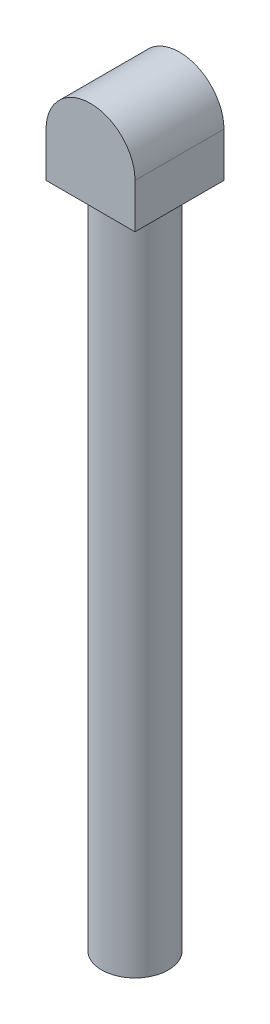
ISO-10303-21;
HEADER;
FILE_DESCRIPTION(('STEP AP214'),'2;1');
FILE_NAME('part.step','',(''),(''),'','','');
FILE_SCHEMA(('AUTOMOTIVE_DESIGN { 1 0 10303 214 1 1 1 1 }'));
ENDSEC;
DATA;
#1=APPLICATION_CONTEXT('core data for automotive mechanical design processes');
#2=APPLICATION_PROTOCOL_DEFINITION('international standard','automotive_design',2000,#1);
#3=PRODUCT_CONTEXT('',#1,'mechanical');
#4=PRODUCT('Part','Part','',(#3));
#5=PRODUCT_RELATED_PRODUCT_CATEGORY('part','',(#4));
#6=PRODUCT_DEFINITION_FORMATION('','',#4);
#7=PRODUCT_DEFINITION_CONTEXT('part definition',#1,'design');
#8=PRODUCT_DEFINITION('design','',#6,#7);
#9=PRODUCT_DEFINITION_SHAPE('','',#8);
#10=(LENGTH_UNIT() NAMED_UNIT(*) SI_UNIT(.MILLI.,.METRE.));
#11=(NAMED_UNIT(*) PLANE_ANGLE_UNIT() SI_UNIT($,.RADIAN.));
#12=(NAMED_UNIT(*) SI_UNIT($,.STERADIAN.) SOLID_ANGLE_UNIT());
#13=UNCERTAINTY_MEASURE_WITH_UNIT(LENGTH_MEASURE(1.E-05),#10,'distance_accuracy_value','');
#14=(GEOMETRIC_REPRESENTATION_CONTEXT(3) GLOBAL_UNCERTAINTY_ASSIGNED_CONTEXT((#13)) GLOBAL_UNIT_ASSIGNED_CONTEXT((#10,
#11,#12)) REPRESENTATION_CONTEXT('',''));
#15=CARTESIAN_POINT('',(0.,0.,0.));
#16=DIRECTION('',(0.,0.,1.));
#17=DIRECTION('',(1.,0.,0.));
#18=AXIS2_PLACEMENT_3D('',#15,#16,#17);
#19=CARTESIAN_POINT('',(4.,8.,-4.));
#20=DIRECTION('',(-1.,0.,0.));
#21=DIRECTION('',(0.,0.,1.));
#22=AXIS2_PLACEMENT_3D('',#19,#20,#21);
#23=PLANE('',#22);
#24=DIRECTION('',(0.,0.,1.));
#25=VECTOR('',#24,1.);
#26=CARTESIAN_POINT('',(4.,4.,-4.));
#27=LINE('',#26,#25);
#28=CARTESIAN_POINT('',(4.,4.,-4.));
#29=VERTEX_POINT('',#28);
#30=CARTESIAN_POINT('',(4.,4.,4.));
#31=VERTEX_POINT('',#30);
#32=EDGE_CURVE('E54',#29,#31,#27,.T.);
#33=ORIENTED_EDGE('',*,*,#32,.T.);
#34=DIRECTION('',(0.,-1.,0.));
#35=VECTOR('',#34,1.);
#36=CARTESIAN_POINT('',(4.,8.,4.));
#37=LINE('',#36,#35);
#38=CARTESIAN_POINT('',(4.,0.,4.));
#39=VERTEX_POINT('',#38);
#40=EDGE_CURVE('E96',#31,#39,#37,.T.);
#41=ORIENTED_EDGE('',*,*,#40,.T.);
#42=DIRECTION('',(0.,0.,-1.));
#43=VECTOR('',#42,1.);
#44=CARTESIAN_POINT('',(4.,0.,-4.));
#45=LINE('',#44,#43);
#46=CARTESIAN_POINT('',(4.,0.,-4.));
#47=VERTEX_POINT('',#46);
#48=EDGE_CURVE('E98',#39,#47,#45,.T.);
#49=ORIENTED_EDGE('',*,*,#48,.T.);
#50=DIRECTION('',(0.,-1.,0.));
#51=VECTOR('',#50,1.);
#52=CARTESIAN_POINT('',(4.,8.,-4.));
#53=LINE('',#52,#51);
#54=EDGE_CURVE('E94',#29,#47,#53,.T.);
#55=ORIENTED_EDGE('',*,*,#54,.F.);
#56=EDGE_LOOP('',(#33,#41,#49,#55));
#57=FACE_BOUND('',#56,.T.);
#58=ADVANCED_FACE('F38',(#57),#23,.F.);
#59=CARTESIAN_POINT('',(-4.,8.,-4.));
#60=DIRECTION('',(1.,0.,0.));
#61=DIRECTION('',(0.,0.,-1.));
#62=AXIS2_PLACEMENT_3D('',#59,#60,#61);
#63=PLANE('',#62);
#64=DIRECTION('',(0.,-1.,0.));
#65=VECTOR('',#64,1.);
#66=CARTESIAN_POINT('',(-4.,8.,4.));
#67=LINE('',#66,#65);
#68=CARTESIAN_POINT('',(-4.,4.,4.));
#69=VERTEX_POINT('',#68);
#70=CARTESIAN_POINT('',(-4.,0.,4.));
#71=VERTEX_POINT('',#70);
#72=EDGE_CURVE('E42',#69,#71,#67,.T.);
#73=ORIENTED_EDGE('',*,*,#72,.F.);
#74=DIRECTION('',(0.,0.,1.));
#75=VECTOR('',#74,1.);
#76=CARTESIAN_POINT('',(-4.,4.,-4.));
#77=LINE('',#76,#75);
#78=CARTESIAN_POINT('',(-4.,4.,-4.));
#79=VERTEX_POINT('',#78);
#80=EDGE_CURVE('E81',#79,#69,#77,.T.);
#81=ORIENTED_EDGE('',*,*,#80,.F.);
#82=DIRECTION('',(0.,-1.,0.));
#83=VECTOR('',#82,1.);
#84=CARTESIAN_POINT('',(-4.,8.,-4.));
#85=LINE('',#84,#83);
#86=CARTESIAN_POINT('',(-4.,0.,-4.));
#87=VERTEX_POINT('',#86);
#88=EDGE_CURVE('E62',#79,#87,#85,.T.);
#89=ORIENTED_EDGE('',*,*,#88,.T.);
#90=DIRECTION('',(0.,0.,1.));
#91=VECTOR('',#90,1.);
#92=CARTESIAN_POINT('',(-4.,0.,-4.));
#93=LINE('',#92,#91);
#94=EDGE_CURVE('E88',#87,#71,#93,.T.);
#95=ORIENTED_EDGE('',*,*,#94,.T.);
#96=EDGE_LOOP('',(#73,#81,#89,#95));
#97=FACE_BOUND('',#96,.T.);
#98=ADVANCED_FACE('F40',(#97),#63,.F.);
#99=CARTESIAN_POINT('',(-4.,8.,4.));
#100=DIRECTION('',(0.,0.,-1.));
#101=DIRECTION('',(-1.,0.,0.));
#102=AXIS2_PLACEMENT_3D('',#99,#100,#101);
#103=PLANE('',#102);
#104=ORIENTED_EDGE('',*,*,#40,.F.);
#105=CARTESIAN_POINT('',(0.,4.,4.));
#106=DIRECTION('',(0.,0.,-1.));
#107=DIRECTION('',(1.,0.,0.));
#108=AXIS2_PLACEMENT_3D('',#105,#106,#107);
#109=CIRCLE('',#108,4.);
#110=EDGE_CURVE('E85',#69,#31,#109,.T.);
#111=ORIENTED_EDGE('',*,*,#110,.F.);
#112=ORIENTED_EDGE('',*,*,#72,.T.);
#113=DIRECTION('',(1.,0.,0.));
#114=VECTOR('',#113,1.);
#115=CARTESIAN_POINT('',(-4.,0.,4.));
#116=LINE('',#115,#114);
#117=EDGE_CURVE('E108',#71,#39,#116,.T.);
#118=ORIENTED_EDGE('',*,*,#117,.T.);
#119=EDGE_LOOP('',(#104,#111,#112,#118));
#120=FACE_BOUND('',#119,.T.);
#121=ADVANCED_FACE('F107',(#120),#103,.F.);
#122=CARTESIAN_POINT('',(-4.,8.,-4.));
#123=DIRECTION('',(0.,0.,1.));
#124=DIRECTION('',(1.,0.,0.));
#125=AXIS2_PLACEMENT_3D('',#122,#123,#124);
#126=PLANE('',#125);
#127=ORIENTED_EDGE('',*,*,#88,.F.);
#128=CARTESIAN_POINT('',(0.,4.,-4.));
#129=DIRECTION('',(0.,0.,-1.));
#130=DIRECTION('',(1.,0.,0.));
#131=AXIS2_PLACEMENT_3D('',#128,#129,#130);
#132=CIRCLE('',#131,4.);
#133=EDGE_CURVE('E79',#79,#29,#132,.T.);
#134=ORIENTED_EDGE('',*,*,#133,.T.);
#135=ORIENTED_EDGE('',*,*,#54,.T.);
#136=DIRECTION('',(-1.,0.,0.));
#137=VECTOR('',#136,1.);
#138=CARTESIAN_POINT('',(-4.,0.,-4.));
#139=LINE('',#138,#137);
#140=EDGE_CURVE('E92',#47,#87,#139,.T.);
#141=ORIENTED_EDGE('',*,*,#140,.T.);
#142=EDGE_LOOP('',(#127,#134,#135,#141));
#143=FACE_BOUND('',#142,.T.);
#144=ADVANCED_FACE('F90',(#143),#126,.F.);
#145=CARTESIAN_POINT('',(0.,0.,0.));
#146=DIRECTION('',(0.,1.,0.));
#147=DIRECTION('',(0.,0.,1.));
#148=AXIS2_PLACEMENT_3D('',#145,#146,#147);
#149=PLANE('',#148);
#150=CARTESIAN_POINT('',(0.,0.,0.));
#151=DIRECTION('',(0.,-1.,0.));
#152=DIRECTION('',(0.,0.,-1.));
#153=AXIS2_PLACEMENT_3D('',#150,#151,#152);
#154=CIRCLE('',#153,3.);
#155=CARTESIAN_POINT('',(0.,0.,-3.));
#156=VERTEX_POINT('',#155);
#157=EDGE_CURVE('E11',#156,#156,#154,.T.);
#158=ORIENTED_EDGE('',*,*,#157,.F.);
#159=EDGE_LOOP('',(#158));
#160=FACE_BOUND('',#159,.T.);
#161=ORIENTED_EDGE('',*,*,#94,.F.);
#162=ORIENTED_EDGE('',*,*,#140,.F.);
#163=ORIENTED_EDGE('',*,*,#48,.F.);
#164=ORIENTED_EDGE('',*,*,#117,.F.);
#165=EDGE_LOOP('',(#161,#162,#163,#164));
#166=FACE_BOUND('',#165,.T.);
#167=ADVANCED_FACE('F111',(#160,#166),#149,.F.);
#168=CARTESIAN_POINT('',(0.,4.,-4.));
#169=DIRECTION('',(0.,0.,1.));
#170=DIRECTION('',(1.,0.,0.));
#171=AXIS2_PLACEMENT_3D('',#168,#169,#170);
#172=CYLINDRICAL_SURFACE('',#171,4.);
#173=ORIENTED_EDGE('',*,*,#110,.T.);
#174=ORIENTED_EDGE('',*,*,#32,.F.);
#175=ORIENTED_EDGE('',*,*,#133,.F.);
#176=ORIENTED_EDGE('',*,*,#80,.T.);
#177=EDGE_LOOP('',(#173,#174,#175,#176));
#178=FACE_BOUND('',#177,.T.);
#179=ADVANCED_FACE('F80',(#178),#172,.T.);
#180=CARTESIAN_POINT('',(0.,-60.,0.));
#181=DIRECTION('',(0.,1.,0.));
#182=DIRECTION('',(0.,0.,1.));
#183=AXIS2_PLACEMENT_3D('',#180,#181,#182);
#184=CYLINDRICAL_SURFACE('',#183,3.);
#185=CARTESIAN_POINT('',(0.,-60.,0.));
#186=DIRECTION('',(0.,-1.,0.));
#187=DIRECTION('',(0.,0.,-1.));
#188=AXIS2_PLACEMENT_3D('',#185,#186,#187);
#189=CIRCLE('',#188,3.);
#190=CARTESIAN_POINT('',(0.,-60.,-3.));
#191=VERTEX_POINT('',#190);
#192=EDGE_CURVE('E147',#191,#191,#189,.T.);
#193=ORIENTED_EDGE('',*,*,#192,.F.);
#194=EDGE_LOOP('',(#193));
#195=FACE_BOUND('',#194,.T.);
#196=ORIENTED_EDGE('',*,*,#157,.T.);
#197=EDGE_LOOP('',(#196));
#198=FACE_BOUND('',#197,.T.);
#199=ADVANCED_FACE('F133',(#195,#198),#184,.T.);
#200=CARTESIAN_POINT('',(0.,-60.,0.));
#201=DIRECTION('',(0.,-1.,0.));
#202=DIRECTION('',(0.,0.,-1.));
#203=AXIS2_PLACEMENT_3D('',#200,#201,#202);
#204=PLANE('',#203);
#205=ORIENTED_EDGE('',*,*,#192,.T.);
#206=EDGE_LOOP('',(#205));
#207=FACE_BOUND('',#206,.T.);
#208=ADVANCED_FACE('F139',(#207),#204,.T.);
#209=CLOSED_SHELL('',(#58,#98,#121,#144,#167,#179,#199,#208));
#210=MANIFOLD_SOLID_BREP('B2',#209);
#211=ADVANCED_BREP_SHAPE_REPRESENTATION('',(#18,#210),#14);
#212=SHAPE_DEFINITION_REPRESENTATION(#9,#211);
ENDSEC;
END-ISO-10303-21;
